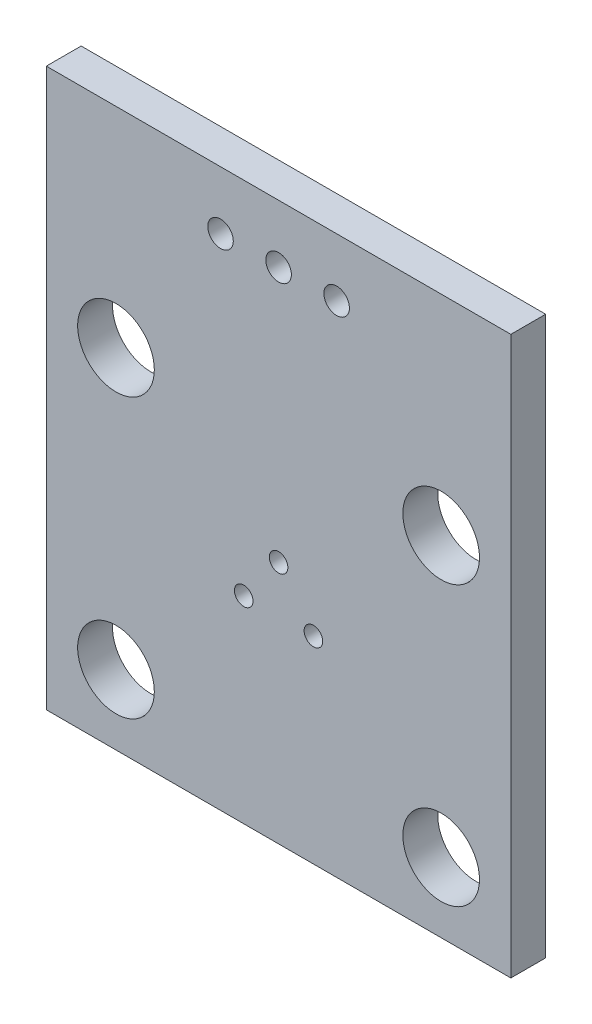
ISO-10303-21;
HEADER;
FILE_DESCRIPTION(('STEP AP214'),'2;1');
FILE_NAME('part.step','',(''),(''),'','','');
FILE_SCHEMA(('AUTOMOTIVE_DESIGN { 1 0 10303 214 1 1 1 1 }'));
ENDSEC;
DATA;
#1=APPLICATION_CONTEXT('core data for automotive mechanical design processes');
#2=APPLICATION_PROTOCOL_DEFINITION('international standard','automotive_design',2000,#1);
#3=PRODUCT_CONTEXT('',#1,'mechanical');
#4=PRODUCT('Part','Part','',(#3));
#5=PRODUCT_RELATED_PRODUCT_CATEGORY('part','',(#4));
#6=PRODUCT_DEFINITION_FORMATION('','',#4);
#7=PRODUCT_DEFINITION_CONTEXT('part definition',#1,'design');
#8=PRODUCT_DEFINITION('design','',#6,#7);
#9=PRODUCT_DEFINITION_SHAPE('','',#8);
#10=(LENGTH_UNIT() NAMED_UNIT(*) SI_UNIT(.MILLI.,.METRE.));
#11=(NAMED_UNIT(*) PLANE_ANGLE_UNIT() SI_UNIT($,.RADIAN.));
#12=(NAMED_UNIT(*) SI_UNIT($,.STERADIAN.) SOLID_ANGLE_UNIT());
#13=UNCERTAINTY_MEASURE_WITH_UNIT(LENGTH_MEASURE(1.E-05),#10,'distance_accuracy_value','');
#14=(GEOMETRIC_REPRESENTATION_CONTEXT(3) GLOBAL_UNCERTAINTY_ASSIGNED_CONTEXT((#13)) GLOBAL_UNIT_ASSIGNED_CONTEXT((#10,
#11,#12)) REPRESENTATION_CONTEXT('',''));
#15=CARTESIAN_POINT('',(0.,0.,0.));
#16=DIRECTION('',(0.,0.,1.));
#17=DIRECTION('',(1.,0.,0.));
#18=AXIS2_PLACEMENT_3D('',#15,#16,#17);
#19=CARTESIAN_POINT('',(0.,24.,1.5));
#20=DIRECTION('',(0.,0.,-1.));
#21=DIRECTION('',(-1.,0.,0.));
#22=AXIS2_PLACEMENT_3D('',#19,#20,#21);
#23=PLANE('',#22);
#24=CARTESIAN_POINT('',(11.5,8.5,1.5));
#25=DIRECTION('',(0.,0.,1.));
#26=DIRECTION('',(1.,0.,0.));
#27=AXIS2_PLACEMENT_3D('',#24,#25,#26);
#28=CIRCLE('',#27,0.399999999999999);
#29=CARTESIAN_POINT('',(11.9,8.5,1.5));
#30=VERTEX_POINT('',#29);
#31=EDGE_CURVE('E154',#30,#30,#28,.T.);
#32=ORIENTED_EDGE('',*,*,#31,.F.);
#33=EDGE_LOOP('',(#32));
#34=FACE_BOUND('',#33,.T.);
#35=CARTESIAN_POINT('',(12.5,21.5,1.5));
#36=DIRECTION('',(0.,0.,1.));
#37=DIRECTION('',(1.,0.,0.));
#38=AXIS2_PLACEMENT_3D('',#35,#36,#37);
#39=CIRCLE('',#38,0.549999999999994);
#40=CARTESIAN_POINT('',(13.05,21.5,1.5));
#41=VERTEX_POINT('',#40);
#42=EDGE_CURVE('E142',#41,#41,#39,.T.);
#43=ORIENTED_EDGE('',*,*,#42,.F.);
#44=EDGE_LOOP('',(#43));
#45=FACE_BOUND('',#44,.T.);
#46=CARTESIAN_POINT('',(7.5,21.5,1.5));
#47=DIRECTION('',(0.,0.,1.));
#48=DIRECTION('',(1.,0.,0.));
#49=AXIS2_PLACEMENT_3D('',#46,#47,#48);
#50=CIRCLE('',#49,0.549999999999996);
#51=CARTESIAN_POINT('',(8.05,21.5,1.5));
#52=VERTEX_POINT('',#51);
#53=EDGE_CURVE('E130',#52,#52,#50,.T.);
#54=ORIENTED_EDGE('',*,*,#53,.F.);
#55=EDGE_LOOP('',(#54));
#56=FACE_BOUND('',#55,.T.);
#57=CARTESIAN_POINT('',(17.,15.,1.5));
#58=DIRECTION('',(0.,0.,1.));
#59=DIRECTION('',(1.,0.,0.));
#60=AXIS2_PLACEMENT_3D('',#57,#58,#59);
#61=CIRCLE('',#60,1.65);
#62=CARTESIAN_POINT('',(18.65,15.,1.5));
#63=VERTEX_POINT('',#62);
#64=EDGE_CURVE('E118',#63,#63,#61,.T.);
#65=ORIENTED_EDGE('',*,*,#64,.F.);
#66=EDGE_LOOP('',(#65));
#67=FACE_BOUND('',#66,.T.);
#68=CARTESIAN_POINT('',(3.,3.,1.5));
#69=DIRECTION('',(0.,0.,1.));
#70=DIRECTION('',(1.,0.,0.));
#71=AXIS2_PLACEMENT_3D('',#68,#69,#70);
#72=CIRCLE('',#71,1.65);
#73=CARTESIAN_POINT('',(4.65,3.,1.5));
#74=VERTEX_POINT('',#73);
#75=EDGE_CURVE('E97',#74,#74,#72,.T.);
#76=ORIENTED_EDGE('',*,*,#75,.F.);
#77=EDGE_LOOP('',(#76));
#78=FACE_BOUND('',#77,.T.);
#79=DIRECTION('',(0.,-1.,0.));
#80=VECTOR('',#79,1.);
#81=CARTESIAN_POINT('',(0.,0.,1.5));
#82=LINE('',#81,#80);
#83=CARTESIAN_POINT('',(0.,24.,1.5));
#84=VERTEX_POINT('',#83);
#85=CARTESIAN_POINT('',(0.,0.,1.5));
#86=VERTEX_POINT('',#85);
#87=EDGE_CURVE('E82',#84,#86,#82,.T.);
#88=ORIENTED_EDGE('',*,*,#87,.T.);
#89=DIRECTION('',(1.,0.,0.));
#90=VECTOR('',#89,1.);
#91=CARTESIAN_POINT('',(0.,0.,1.5));
#92=LINE('',#91,#90);
#93=CARTESIAN_POINT('',(20.,0.,1.5));
#94=VERTEX_POINT('',#93);
#95=EDGE_CURVE('E77',#86,#94,#92,.T.);
#96=ORIENTED_EDGE('',*,*,#95,.T.);
#97=DIRECTION('',(0.,1.,0.));
#98=VECTOR('',#97,1.);
#99=CARTESIAN_POINT('',(20.,0.,1.5));
#100=LINE('',#99,#98);
#101=CARTESIAN_POINT('',(20.,24.,1.5));
#102=VERTEX_POINT('',#101);
#103=EDGE_CURVE('E80',#94,#102,#100,.T.);
#104=ORIENTED_EDGE('',*,*,#103,.T.);
#105=DIRECTION('',(-1.,0.,0.));
#106=VECTOR('',#105,1.);
#107=CARTESIAN_POINT('',(0.,24.,1.5));
#108=LINE('',#107,#106);
#109=EDGE_CURVE('E47',#102,#84,#108,.T.);
#110=ORIENTED_EDGE('',*,*,#109,.T.);
#111=EDGE_LOOP('',(#88,#96,#104,#110));
#112=FACE_BOUND('',#111,.T.);
#113=CARTESIAN_POINT('',(17.,3.,1.5));
#114=DIRECTION('',(0.,0.,1.));
#115=DIRECTION('',(1.,0.,0.));
#116=AXIS2_PLACEMENT_3D('',#113,#114,#115);
#117=CIRCLE('',#116,1.65);
#118=CARTESIAN_POINT('',(18.65,3.,1.5));
#119=VERTEX_POINT('',#118);
#120=EDGE_CURVE('E112',#119,#119,#117,.T.);
#121=ORIENTED_EDGE('',*,*,#120,.F.);
#122=EDGE_LOOP('',(#121));
#123=FACE_BOUND('',#122,.T.);
#124=CARTESIAN_POINT('',(3.,15.,1.5));
#125=DIRECTION('',(0.,0.,1.));
#126=DIRECTION('',(1.,0.,0.));
#127=AXIS2_PLACEMENT_3D('',#124,#125,#126);
#128=CIRCLE('',#127,1.65);
#129=CARTESIAN_POINT('',(4.65,15.,1.5));
#130=VERTEX_POINT('',#129);
#131=EDGE_CURVE('E124',#130,#130,#128,.T.);
#132=ORIENTED_EDGE('',*,*,#131,.F.);
#133=EDGE_LOOP('',(#132));
#134=FACE_BOUND('',#133,.T.);
#135=CARTESIAN_POINT('',(10.,21.5,1.5));
#136=DIRECTION('',(0.,0.,1.));
#137=DIRECTION('',(1.,0.,0.));
#138=AXIS2_PLACEMENT_3D('',#135,#136,#137);
#139=CIRCLE('',#138,0.549999999999996);
#140=CARTESIAN_POINT('',(10.55,21.5,1.5));
#141=VERTEX_POINT('',#140);
#142=EDGE_CURVE('E136',#141,#141,#139,.T.);
#143=ORIENTED_EDGE('',*,*,#142,.F.);
#144=EDGE_LOOP('',(#143));
#145=FACE_BOUND('',#144,.T.);
#146=CARTESIAN_POINT('',(10.,10.5,1.5));
#147=DIRECTION('',(0.,0.,1.));
#148=DIRECTION('',(1.,0.,0.));
#149=AXIS2_PLACEMENT_3D('',#146,#147,#148);
#150=CIRCLE('',#149,0.399999999999999);
#151=CARTESIAN_POINT('',(10.4,10.5,1.5));
#152=VERTEX_POINT('',#151);
#153=EDGE_CURVE('E148',#152,#152,#150,.T.);
#154=ORIENTED_EDGE('',*,*,#153,.F.);
#155=EDGE_LOOP('',(#154));
#156=FACE_BOUND('',#155,.T.);
#157=CARTESIAN_POINT('',(8.5,8.5,1.5));
#158=DIRECTION('',(0.,0.,1.));
#159=DIRECTION('',(1.,0.,0.));
#160=AXIS2_PLACEMENT_3D('',#157,#158,#159);
#161=CIRCLE('',#160,0.399999999999999);
#162=CARTESIAN_POINT('',(8.9,8.5,1.5));
#163=VERTEX_POINT('',#162);
#164=EDGE_CURVE('E160',#163,#163,#161,.T.);
#165=ORIENTED_EDGE('',*,*,#164,.F.);
#166=EDGE_LOOP('',(#165));
#167=FACE_BOUND('',#166,.T.);
#168=ADVANCED_FACE('F30',(#34,#45,#56,#67,#78,#112,#123,#134,#145,#156,#167),#23,.F.);
#169=CARTESIAN_POINT('',(0.,24.,0.));
#170=DIRECTION('',(0.,0.,-1.));
#171=DIRECTION('',(-1.,0.,0.));
#172=AXIS2_PLACEMENT_3D('',#169,#170,#171);
#173=PLANE('',#172);
#174=CARTESIAN_POINT('',(11.5,8.5,0.));
#175=DIRECTION('',(0.,0.,1.));
#176=DIRECTION('',(1.,0.,0.));
#177=AXIS2_PLACEMENT_3D('',#174,#175,#176);
#178=CIRCLE('',#177,0.399999999999999);
#179=CARTESIAN_POINT('',(11.9,8.5,0.));
#180=VERTEX_POINT('',#179);
#181=EDGE_CURVE('E157',#180,#180,#178,.T.);
#182=ORIENTED_EDGE('',*,*,#181,.T.);
#183=EDGE_LOOP('',(#182));
#184=FACE_BOUND('',#183,.T.);
#185=CARTESIAN_POINT('',(12.5,21.5,0.));
#186=DIRECTION('',(0.,0.,1.));
#187=DIRECTION('',(1.,0.,0.));
#188=AXIS2_PLACEMENT_3D('',#185,#186,#187);
#189=CIRCLE('',#188,0.549999999999994);
#190=CARTESIAN_POINT('',(13.05,21.5,0.));
#191=VERTEX_POINT('',#190);
#192=EDGE_CURVE('E145',#191,#191,#189,.T.);
#193=ORIENTED_EDGE('',*,*,#192,.T.);
#194=EDGE_LOOP('',(#193));
#195=FACE_BOUND('',#194,.T.);
#196=CARTESIAN_POINT('',(7.5,21.5,0.));
#197=DIRECTION('',(0.,0.,1.));
#198=DIRECTION('',(1.,0.,0.));
#199=AXIS2_PLACEMENT_3D('',#196,#197,#198);
#200=CIRCLE('',#199,0.549999999999996);
#201=CARTESIAN_POINT('',(8.05,21.5,0.));
#202=VERTEX_POINT('',#201);
#203=EDGE_CURVE('E133',#202,#202,#200,.T.);
#204=ORIENTED_EDGE('',*,*,#203,.T.);
#205=EDGE_LOOP('',(#204));
#206=FACE_BOUND('',#205,.T.);
#207=CARTESIAN_POINT('',(17.,15.,0.));
#208=DIRECTION('',(0.,0.,1.));
#209=DIRECTION('',(1.,0.,0.));
#210=AXIS2_PLACEMENT_3D('',#207,#208,#209);
#211=CIRCLE('',#210,1.65);
#212=CARTESIAN_POINT('',(18.65,15.,0.));
#213=VERTEX_POINT('',#212);
#214=EDGE_CURVE('E121',#213,#213,#211,.T.);
#215=ORIENTED_EDGE('',*,*,#214,.T.);
#216=EDGE_LOOP('',(#215));
#217=FACE_BOUND('',#216,.T.);
#218=CARTESIAN_POINT('',(3.,3.,0.));
#219=DIRECTION('',(0.,0.,1.));
#220=DIRECTION('',(1.,0.,0.));
#221=AXIS2_PLACEMENT_3D('',#218,#219,#220);
#222=CIRCLE('',#221,1.65);
#223=CARTESIAN_POINT('',(4.65,3.,0.));
#224=VERTEX_POINT('',#223);
#225=EDGE_CURVE('E109',#224,#224,#222,.T.);
#226=ORIENTED_EDGE('',*,*,#225,.T.);
#227=EDGE_LOOP('',(#226));
#228=FACE_BOUND('',#227,.T.);
#229=DIRECTION('',(0.,-1.,0.));
#230=VECTOR('',#229,1.);
#231=CARTESIAN_POINT('',(0.,0.,0.));
#232=LINE('',#231,#230);
#233=CARTESIAN_POINT('',(0.,24.,0.));
#234=VERTEX_POINT('',#233);
#235=CARTESIAN_POINT('',(0.,0.,0.));
#236=VERTEX_POINT('',#235);
#237=EDGE_CURVE('E94',#234,#236,#232,.T.);
#238=ORIENTED_EDGE('',*,*,#237,.F.);
#239=DIRECTION('',(-1.,0.,0.));
#240=VECTOR('',#239,1.);
#241=CARTESIAN_POINT('',(0.,24.,0.));
#242=LINE('',#241,#240);
#243=CARTESIAN_POINT('',(20.,24.,0.));
#244=VERTEX_POINT('',#243);
#245=EDGE_CURVE('E70',#244,#234,#242,.T.);
#246=ORIENTED_EDGE('',*,*,#245,.F.);
#247=DIRECTION('',(0.,1.,0.));
#248=VECTOR('',#247,1.);
#249=CARTESIAN_POINT('',(20.,0.,0.));
#250=LINE('',#249,#248);
#251=CARTESIAN_POINT('',(20.,0.,0.));
#252=VERTEX_POINT('',#251);
#253=EDGE_CURVE('E64',#252,#244,#250,.T.);
#254=ORIENTED_EDGE('',*,*,#253,.F.);
#255=DIRECTION('',(1.,0.,0.));
#256=VECTOR('',#255,1.);
#257=CARTESIAN_POINT('',(0.,0.,0.));
#258=LINE('',#257,#256);
#259=EDGE_CURVE('E86',#236,#252,#258,.T.);
#260=ORIENTED_EDGE('',*,*,#259,.F.);
#261=EDGE_LOOP('',(#238,#246,#254,#260));
#262=FACE_BOUND('',#261,.T.);
#263=CARTESIAN_POINT('',(17.,3.,0.));
#264=DIRECTION('',(0.,0.,1.));
#265=DIRECTION('',(1.,0.,0.));
#266=AXIS2_PLACEMENT_3D('',#263,#264,#265);
#267=CIRCLE('',#266,1.65);
#268=CARTESIAN_POINT('',(18.65,3.,0.));
#269=VERTEX_POINT('',#268);
#270=EDGE_CURVE('E115',#269,#269,#267,.T.);
#271=ORIENTED_EDGE('',*,*,#270,.T.);
#272=EDGE_LOOP('',(#271));
#273=FACE_BOUND('',#272,.T.);
#274=CARTESIAN_POINT('',(3.,15.,0.));
#275=DIRECTION('',(0.,0.,1.));
#276=DIRECTION('',(1.,0.,0.));
#277=AXIS2_PLACEMENT_3D('',#274,#275,#276);
#278=CIRCLE('',#277,1.65);
#279=CARTESIAN_POINT('',(4.65,15.,0.));
#280=VERTEX_POINT('',#279);
#281=EDGE_CURVE('E127',#280,#280,#278,.T.);
#282=ORIENTED_EDGE('',*,*,#281,.T.);
#283=EDGE_LOOP('',(#282));
#284=FACE_BOUND('',#283,.T.);
#285=CARTESIAN_POINT('',(10.,21.5,0.));
#286=DIRECTION('',(0.,0.,1.));
#287=DIRECTION('',(1.,0.,0.));
#288=AXIS2_PLACEMENT_3D('',#285,#286,#287);
#289=CIRCLE('',#288,0.549999999999996);
#290=CARTESIAN_POINT('',(10.55,21.5,0.));
#291=VERTEX_POINT('',#290);
#292=EDGE_CURVE('E139',#291,#291,#289,.T.);
#293=ORIENTED_EDGE('',*,*,#292,.T.);
#294=EDGE_LOOP('',(#293));
#295=FACE_BOUND('',#294,.T.);
#296=CARTESIAN_POINT('',(10.,10.5,0.));
#297=DIRECTION('',(0.,0.,1.));
#298=DIRECTION('',(1.,0.,0.));
#299=AXIS2_PLACEMENT_3D('',#296,#297,#298);
#300=CIRCLE('',#299,0.399999999999999);
#301=CARTESIAN_POINT('',(10.4,10.5,0.));
#302=VERTEX_POINT('',#301);
#303=EDGE_CURVE('E151',#302,#302,#300,.T.);
#304=ORIENTED_EDGE('',*,*,#303,.T.);
#305=EDGE_LOOP('',(#304));
#306=FACE_BOUND('',#305,.T.);
#307=CARTESIAN_POINT('',(8.5,8.5,0.));
#308=DIRECTION('',(0.,0.,1.));
#309=DIRECTION('',(1.,0.,0.));
#310=AXIS2_PLACEMENT_3D('',#307,#308,#309);
#311=CIRCLE('',#310,0.399999999999999);
#312=CARTESIAN_POINT('',(8.9,8.5,0.));
#313=VERTEX_POINT('',#312);
#314=EDGE_CURVE('E163',#313,#313,#311,.T.);
#315=ORIENTED_EDGE('',*,*,#314,.T.);
#316=EDGE_LOOP('',(#315));
#317=FACE_BOUND('',#316,.T.);
#318=ADVANCED_FACE('F105',(#184,#195,#206,#217,#228,#262,#273,#284,#295,#306,#317),#173,.T.);
#319=CARTESIAN_POINT('',(0.,0.,1.5));
#320=DIRECTION('',(1.,0.,0.));
#321=DIRECTION('',(0.,0.,-1.));
#322=AXIS2_PLACEMENT_3D('',#319,#320,#321);
#323=PLANE('',#322);
#324=ORIENTED_EDGE('',*,*,#237,.T.);
#325=DIRECTION('',(0.,0.,-1.));
#326=VECTOR('',#325,1.);
#327=CARTESIAN_POINT('',(0.,0.,1.5));
#328=LINE('',#327,#326);
#329=EDGE_CURVE('E11',#86,#236,#328,.T.);
#330=ORIENTED_EDGE('',*,*,#329,.F.);
#331=ORIENTED_EDGE('',*,*,#87,.F.);
#332=DIRECTION('',(0.,0.,-1.));
#333=VECTOR('',#332,1.);
#334=CARTESIAN_POINT('',(0.,24.,1.5));
#335=LINE('',#334,#333);
#336=EDGE_CURVE('E90',#84,#234,#335,.T.);
#337=ORIENTED_EDGE('',*,*,#336,.T.);
#338=EDGE_LOOP('',(#324,#330,#331,#337));
#339=FACE_BOUND('',#338,.T.);
#340=ADVANCED_FACE('F32',(#339),#323,.F.);
#341=CARTESIAN_POINT('',(0.,0.,1.5));
#342=DIRECTION('',(0.,1.,0.));
#343=DIRECTION('',(0.,0.,1.));
#344=AXIS2_PLACEMENT_3D('',#341,#342,#343);
#345=PLANE('',#344);
#346=ORIENTED_EDGE('',*,*,#259,.T.);
#347=DIRECTION('',(0.,0.,-1.));
#348=VECTOR('',#347,1.);
#349=CARTESIAN_POINT('',(20.,0.,1.5));
#350=LINE('',#349,#348);
#351=EDGE_CURVE('E39',#94,#252,#350,.T.);
#352=ORIENTED_EDGE('',*,*,#351,.F.);
#353=ORIENTED_EDGE('',*,*,#95,.F.);
#354=ORIENTED_EDGE('',*,*,#329,.T.);
#355=EDGE_LOOP('',(#346,#352,#353,#354));
#356=FACE_BOUND('',#355,.T.);
#357=ADVANCED_FACE('F85',(#356),#345,.F.);
#358=CARTESIAN_POINT('',(20.,0.,1.5));
#359=DIRECTION('',(-1.,0.,0.));
#360=DIRECTION('',(0.,0.,1.));
#361=AXIS2_PLACEMENT_3D('',#358,#359,#360);
#362=PLANE('',#361);
#363=ORIENTED_EDGE('',*,*,#253,.T.);
#364=DIRECTION('',(0.,0.,-1.));
#365=VECTOR('',#364,1.);
#366=CARTESIAN_POINT('',(20.,24.,1.5));
#367=LINE('',#366,#365);
#368=EDGE_CURVE('E87',#102,#244,#367,.T.);
#369=ORIENTED_EDGE('',*,*,#368,.F.);
#370=ORIENTED_EDGE('',*,*,#103,.F.);
#371=ORIENTED_EDGE('',*,*,#351,.T.);
#372=EDGE_LOOP('',(#363,#369,#370,#371));
#373=FACE_BOUND('',#372,.T.);
#374=ADVANCED_FACE('F88',(#373),#362,.F.);
#375=CARTESIAN_POINT('',(0.,24.,1.5));
#376=DIRECTION('',(0.,-1.,0.));
#377=DIRECTION('',(0.,0.,-1.));
#378=AXIS2_PLACEMENT_3D('',#375,#376,#377);
#379=PLANE('',#378);
#380=ORIENTED_EDGE('',*,*,#245,.T.);
#381=ORIENTED_EDGE('',*,*,#336,.F.);
#382=ORIENTED_EDGE('',*,*,#109,.F.);
#383=ORIENTED_EDGE('',*,*,#368,.T.);
#384=EDGE_LOOP('',(#380,#381,#382,#383));
#385=FACE_BOUND('',#384,.T.);
#386=ADVANCED_FACE('F102',(#385),#379,.F.);
#387=CARTESIAN_POINT('',(3.,3.,1.5));
#388=DIRECTION('',(0.,0.,-1.));
#389=DIRECTION('',(-1.,0.,0.));
#390=AXIS2_PLACEMENT_3D('',#387,#388,#389);
#391=CYLINDRICAL_SURFACE('',#390,1.65);
#392=ORIENTED_EDGE('',*,*,#75,.T.);
#393=EDGE_LOOP('',(#392));
#394=FACE_BOUND('',#393,.T.);
#395=ORIENTED_EDGE('',*,*,#225,.F.);
#396=EDGE_LOOP('',(#395));
#397=FACE_BOUND('',#396,.T.);
#398=ADVANCED_FACE('F183',(#394,#397),#391,.F.);
#399=CARTESIAN_POINT('',(17.,3.,1.5));
#400=DIRECTION('',(0.,0.,-1.));
#401=DIRECTION('',(-1.,0.,0.));
#402=AXIS2_PLACEMENT_3D('',#399,#400,#401);
#403=CYLINDRICAL_SURFACE('',#402,1.65);
#404=ORIENTED_EDGE('',*,*,#120,.T.);
#405=EDGE_LOOP('',(#404));
#406=FACE_BOUND('',#405,.T.);
#407=ORIENTED_EDGE('',*,*,#270,.F.);
#408=EDGE_LOOP('',(#407));
#409=FACE_BOUND('',#408,.T.);
#410=ADVANCED_FACE('F229',(#406,#409),#403,.F.);
#411=CARTESIAN_POINT('',(17.,15.,1.5));
#412=DIRECTION('',(0.,0.,-1.));
#413=DIRECTION('',(-1.,0.,0.));
#414=AXIS2_PLACEMENT_3D('',#411,#412,#413);
#415=CYLINDRICAL_SURFACE('',#414,1.65);
#416=ORIENTED_EDGE('',*,*,#64,.T.);
#417=EDGE_LOOP('',(#416));
#418=FACE_BOUND('',#417,.T.);
#419=ORIENTED_EDGE('',*,*,#214,.F.);
#420=EDGE_LOOP('',(#419));
#421=FACE_BOUND('',#420,.T.);
#422=ADVANCED_FACE('F237',(#418,#421),#415,.F.);
#423=CARTESIAN_POINT('',(3.,15.,1.5));
#424=DIRECTION('',(0.,0.,-1.));
#425=DIRECTION('',(-1.,0.,0.));
#426=AXIS2_PLACEMENT_3D('',#423,#424,#425);
#427=CYLINDRICAL_SURFACE('',#426,1.65);
#428=ORIENTED_EDGE('',*,*,#131,.T.);
#429=EDGE_LOOP('',(#428));
#430=FACE_BOUND('',#429,.T.);
#431=ORIENTED_EDGE('',*,*,#281,.F.);
#432=EDGE_LOOP('',(#431));
#433=FACE_BOUND('',#432,.T.);
#434=ADVANCED_FACE('F245',(#430,#433),#427,.F.);
#435=CARTESIAN_POINT('',(7.5,21.5,1.5));
#436=DIRECTION('',(0.,0.,-1.));
#437=DIRECTION('',(-1.,0.,0.));
#438=AXIS2_PLACEMENT_3D('',#435,#436,#437);
#439=CYLINDRICAL_SURFACE('',#438,0.549999999999996);
#440=ORIENTED_EDGE('',*,*,#53,.T.);
#441=EDGE_LOOP('',(#440));
#442=FACE_BOUND('',#441,.T.);
#443=ORIENTED_EDGE('',*,*,#203,.F.);
#444=EDGE_LOOP('',(#443));
#445=FACE_BOUND('',#444,.T.);
#446=ADVANCED_FACE('F254',(#442,#445),#439,.F.);
#447=CARTESIAN_POINT('',(10.,21.5,1.5));
#448=DIRECTION('',(0.,0.,-1.));
#449=DIRECTION('',(-1.,0.,0.));
#450=AXIS2_PLACEMENT_3D('',#447,#448,#449);
#451=CYLINDRICAL_SURFACE('',#450,0.549999999999996);
#452=ORIENTED_EDGE('',*,*,#142,.T.);
#453=EDGE_LOOP('',(#452));
#454=FACE_BOUND('',#453,.T.);
#455=ORIENTED_EDGE('',*,*,#292,.F.);
#456=EDGE_LOOP('',(#455));
#457=FACE_BOUND('',#456,.T.);
#458=ADVANCED_FACE('F263',(#454,#457),#451,.F.);
#459=CARTESIAN_POINT('',(12.5,21.5,1.5));
#460=DIRECTION('',(0.,0.,-1.));
#461=DIRECTION('',(-1.,0.,0.));
#462=AXIS2_PLACEMENT_3D('',#459,#460,#461);
#463=CYLINDRICAL_SURFACE('',#462,0.549999999999994);
#464=ORIENTED_EDGE('',*,*,#42,.T.);
#465=EDGE_LOOP('',(#464));
#466=FACE_BOUND('',#465,.T.);
#467=ORIENTED_EDGE('',*,*,#192,.F.);
#468=EDGE_LOOP('',(#467));
#469=FACE_BOUND('',#468,.T.);
#470=ADVANCED_FACE('F272',(#466,#469),#463,.F.);
#471=CARTESIAN_POINT('',(10.,10.5,1.5));
#472=DIRECTION('',(0.,0.,-1.));
#473=DIRECTION('',(-1.,0.,0.));
#474=AXIS2_PLACEMENT_3D('',#471,#472,#473);
#475=CYLINDRICAL_SURFACE('',#474,0.399999999999999);
#476=ORIENTED_EDGE('',*,*,#153,.T.);
#477=EDGE_LOOP('',(#476));
#478=FACE_BOUND('',#477,.T.);
#479=ORIENTED_EDGE('',*,*,#303,.F.);
#480=EDGE_LOOP('',(#479));
#481=FACE_BOUND('',#480,.T.);
#482=ADVANCED_FACE('F281',(#478,#481),#475,.F.);
#483=CARTESIAN_POINT('',(11.5,8.5,1.5));
#484=DIRECTION('',(0.,0.,-1.));
#485=DIRECTION('',(-1.,0.,0.));
#486=AXIS2_PLACEMENT_3D('',#483,#484,#485);
#487=CYLINDRICAL_SURFACE('',#486,0.399999999999999);
#488=ORIENTED_EDGE('',*,*,#31,.T.);
#489=EDGE_LOOP('',(#488));
#490=FACE_BOUND('',#489,.T.);
#491=ORIENTED_EDGE('',*,*,#181,.F.);
#492=EDGE_LOOP('',(#491));
#493=FACE_BOUND('',#492,.T.);
#494=ADVANCED_FACE('F290',(#490,#493),#487,.F.);
#495=CARTESIAN_POINT('',(8.5,8.5,1.5));
#496=DIRECTION('',(0.,0.,-1.));
#497=DIRECTION('',(-1.,0.,0.));
#498=AXIS2_PLACEMENT_3D('',#495,#496,#497);
#499=CYLINDRICAL_SURFACE('',#498,0.399999999999999);
#500=ORIENTED_EDGE('',*,*,#164,.T.);
#501=EDGE_LOOP('',(#500));
#502=FACE_BOUND('',#501,.T.);
#503=ORIENTED_EDGE('',*,*,#314,.F.);
#504=EDGE_LOOP('',(#503));
#505=FACE_BOUND('',#504,.T.);
#506=ADVANCED_FACE('F169',(#502,#505),#499,.F.);
#507=CLOSED_SHELL('',(#168,#318,#340,#357,#374,#386,#398,#410,#422,#434,#446,#458,#470,#482,
#494,#506));
#508=MANIFOLD_SOLID_BREP('B2',#507);
#509=ADVANCED_BREP_SHAPE_REPRESENTATION('',(#18,#508),#14);
#510=SHAPE_DEFINITION_REPRESENTATION(#9,#509);
ENDSEC;
END-ISO-10303-21;
